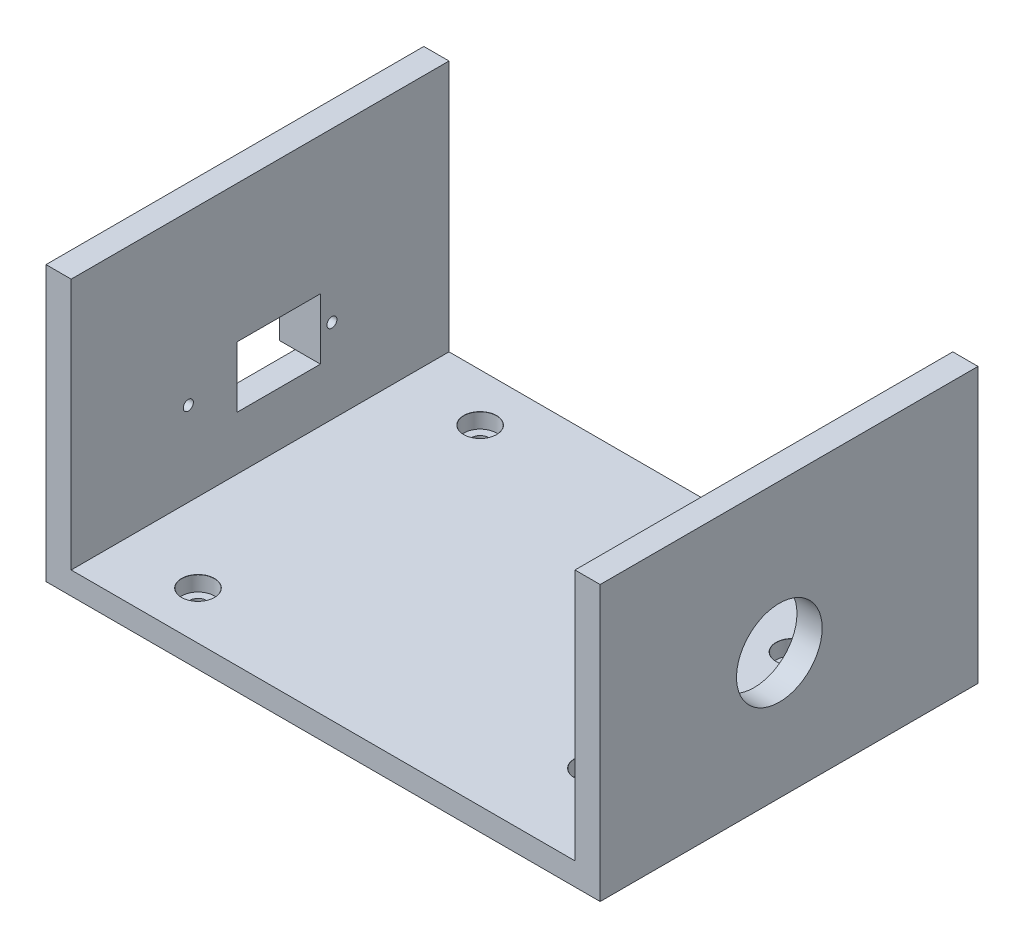
ISO-10303-21;
HEADER;
FILE_DESCRIPTION(('STEP AP214'),'2;1');
FILE_NAME('part.step','',(''),(''),'','','');
FILE_SCHEMA(('AUTOMOTIVE_DESIGN { 1 0 10303 214 1 1 1 1 }'));
ENDSEC;
DATA;
#1=APPLICATION_CONTEXT('core data for automotive mechanical design processes');
#2=APPLICATION_PROTOCOL_DEFINITION('international standard','automotive_design',2000,#1);
#3=PRODUCT_CONTEXT('',#1,'mechanical');
#4=PRODUCT('Part','Part','',(#3));
#5=PRODUCT_RELATED_PRODUCT_CATEGORY('part','',(#4));
#6=PRODUCT_DEFINITION_FORMATION('','',#4);
#7=PRODUCT_DEFINITION_CONTEXT('part definition',#1,'design');
#8=PRODUCT_DEFINITION('design','',#6,#7);
#9=PRODUCT_DEFINITION_SHAPE('','',#8);
#10=(LENGTH_UNIT() NAMED_UNIT(*) SI_UNIT(.MILLI.,.METRE.));
#11=(NAMED_UNIT(*) PLANE_ANGLE_UNIT() SI_UNIT($,.RADIAN.));
#12=(NAMED_UNIT(*) SI_UNIT($,.STERADIAN.) SOLID_ANGLE_UNIT());
#13=UNCERTAINTY_MEASURE_WITH_UNIT(LENGTH_MEASURE(1.E-05),#10,'distance_accuracy_value','');
#14=(GEOMETRIC_REPRESENTATION_CONTEXT(3) GLOBAL_UNCERTAINTY_ASSIGNED_CONTEXT((#13)) GLOBAL_UNIT_ASSIGNED_CONTEXT((#10,
#11,#12)) REPRESENTATION_CONTEXT('',''));
#15=CARTESIAN_POINT('',(0.,0.,0.));
#16=DIRECTION('',(0.,0.,1.));
#17=DIRECTION('',(1.,0.,0.));
#18=AXIS2_PLACEMENT_3D('',#15,#16,#17);
#19=CARTESIAN_POINT('',(-43.8907284768212,0.,-52.2019867549669));
#20=DIRECTION('',(-1.,0.,0.));
#21=DIRECTION('',(0.,0.,1.));
#22=AXIS2_PLACEMENT_3D('',#19,#20,#21);
#23=PLANE('',#22);
#24=DIRECTION('',(0.,0.,1.));
#25=VECTOR('',#24,1.);
#26=CARTESIAN_POINT('',(-43.8907284768212,27.25,0.));
#27=LINE('',#26,#25);
#28=CARTESIAN_POINT('',(-43.8907284768212,27.25,-2.95198675496689));
#29=VERTEX_POINT('',#28);
#30=CARTESIAN_POINT('',(-43.8907284768212,27.25,1.54801324503311));
#31=VERTEX_POINT('',#30);
#32=EDGE_CURVE('E415',#29,#31,#27,.T.);
#33=ORIENTED_EDGE('',*,*,#32,.T.);
#34=DIRECTION('',(0.,1.,0.));
#35=VECTOR('',#34,1.);
#36=CARTESIAN_POINT('',(-43.8907284768212,0.,1.54801324503311));
#37=LINE('',#36,#35);
#38=CARTESIAN_POINT('',(-43.8907284768212,15.15,1.54801324503311));
#39=VERTEX_POINT('',#38);
#40=EDGE_CURVE('E421',#39,#31,#37,.T.);
#41=ORIENTED_EDGE('',*,*,#40,.F.);
#42=DIRECTION('',(0.,0.,1.));
#43=VECTOR('',#42,1.);
#44=CARTESIAN_POINT('',(-43.8907284768212,15.15,0.));
#45=LINE('',#44,#43);
#46=CARTESIAN_POINT('',(-43.8907284768212,15.15,-2.95198675496689));
#47=VERTEX_POINT('',#46);
#48=EDGE_CURVE('E437',#47,#39,#45,.T.);
#49=ORIENTED_EDGE('',*,*,#48,.F.);
#50=DIRECTION('',(0.,-1.,0.));
#51=VECTOR('',#50,1.);
#52=CARTESIAN_POINT('',(-43.8907284768212,0.,-2.95198675496689));
#53=LINE('',#52,#51);
#54=EDGE_CURVE('E434',#29,#47,#53,.T.);
#55=ORIENTED_EDGE('',*,*,#54,.F.);
#56=EDGE_LOOP('',(#33,#41,#49,#55));
#57=FACE_BOUND('',#56,.T.);
#58=DIRECTION('',(0.,1.,0.));
#59=VECTOR('',#58,1.);
#60=CARTESIAN_POINT('',(-43.8907284768212,0.,22.7980132450331));
#61=LINE('',#60,#59);
#62=CARTESIAN_POINT('',(-43.8907284768212,0.,22.7980132450331));
#63=VERTEX_POINT('',#62);
#64=CARTESIAN_POINT('',(-43.8907284768212,54.5,22.7980132450331));
#65=VERTEX_POINT('',#64);
#66=EDGE_CURVE('E282',#63,#65,#61,.T.);
#67=ORIENTED_EDGE('',*,*,#66,.T.);
#68=DIRECTION('',(0.,0.,1.));
#69=VECTOR('',#68,1.);
#70=CARTESIAN_POINT('',(-43.8907284768212,54.5,-52.2019867549669));
#71=LINE('',#70,#69);
#72=CARTESIAN_POINT('',(-43.8907284768212,54.5,-52.2019867549669));
#73=VERTEX_POINT('',#72);
#74=EDGE_CURVE('E258',#73,#65,#71,.T.);
#75=ORIENTED_EDGE('',*,*,#74,.F.);
#76=DIRECTION('',(0.,1.,0.));
#77=VECTOR('',#76,1.);
#78=CARTESIAN_POINT('',(-43.8907284768212,0.,-52.2019867549669));
#79=LINE('',#78,#77);
#80=CARTESIAN_POINT('',(-43.8907284768212,0.,-52.2019867549669));
#81=VERTEX_POINT('',#80);
#82=EDGE_CURVE('E274',#81,#73,#79,.T.);
#83=ORIENTED_EDGE('',*,*,#82,.F.);
#84=DIRECTION('',(0.,0.,1.));
#85=VECTOR('',#84,1.);
#86=CARTESIAN_POINT('',(-43.8907284768212,0.,-52.2019867549669));
#87=LINE('',#86,#85);
#88=EDGE_CURVE('E270',#81,#63,#87,.T.);
#89=ORIENTED_EDGE('',*,*,#88,.T.);
#90=EDGE_LOOP('',(#67,#75,#83,#89));
#91=FACE_BOUND('',#90,.T.);
#92=DIRECTION('',(0.,0.,1.));
#93=VECTOR('',#92,1.);
#94=CARTESIAN_POINT('',(-43.8907284768212,27.25,-52.2019867549669));
#95=LINE('',#94,#93);
#96=CARTESIAN_POINT('',(-43.8907284768212,27.25,-26.6706087203549));
#97=VERTEX_POINT('',#96);
#98=CARTESIAN_POINT('',(-43.8907284768212,27.25,-10.0716026257007));
#99=VERTEX_POINT('',#98);
#100=EDGE_CURVE('E403',#97,#99,#95,.T.);
#101=ORIENTED_EDGE('',*,*,#100,.T.);
#102=DIRECTION('',(0.,-1.,0.));
#103=VECTOR('',#102,1.);
#104=CARTESIAN_POINT('',(-43.8907284768212,0.,-10.0716026257007));
#105=LINE('',#104,#103);
#106=CARTESIAN_POINT('',(-43.8907284768212,15.15,-10.0716026257007));
#107=VERTEX_POINT('',#106);
#108=EDGE_CURVE('E11',#99,#107,#105,.T.);
#109=ORIENTED_EDGE('',*,*,#108,.T.);
#110=DIRECTION('',(0.,0.,-1.));
#111=VECTOR('',#110,1.);
#112=CARTESIAN_POINT('',(-43.8907284768212,15.15,-52.2019867549669));
#113=LINE('',#112,#111);
#114=CARTESIAN_POINT('',(-43.8907284768212,15.15,-26.6706087203549));
#115=VERTEX_POINT('',#114);
#116=EDGE_CURVE('E462',#107,#115,#113,.T.);
#117=ORIENTED_EDGE('',*,*,#116,.T.);
#118=DIRECTION('',(0.,0.,1.));
#119=VECTOR('',#118,1.);
#120=CARTESIAN_POINT('',(-43.8907284768212,15.15,0.));
#121=LINE('',#120,#119);
#122=CARTESIAN_POINT('',(-43.8907284768212,15.15,-30.9519867549669));
#123=VERTEX_POINT('',#122);
#124=EDGE_CURVE('E190',#123,#115,#121,.T.);
#125=ORIENTED_EDGE('',*,*,#124,.F.);
#126=DIRECTION('',(0.,1.,0.));
#127=VECTOR('',#126,1.);
#128=CARTESIAN_POINT('',(-43.8907284768212,0.,-30.9519867549669));
#129=LINE('',#128,#127);
#130=CARTESIAN_POINT('',(-43.8907284768212,27.25,-30.9519867549669));
#131=VERTEX_POINT('',#130);
#132=EDGE_CURVE('E213',#123,#131,#129,.T.);
#133=ORIENTED_EDGE('',*,*,#132,.T.);
#134=DIRECTION('',(0.,0.,1.));
#135=VECTOR('',#134,1.);
#136=CARTESIAN_POINT('',(-43.8907284768212,27.25,0.));
#137=LINE('',#136,#135);
#138=EDGE_CURVE('E209',#131,#97,#137,.T.);
#139=ORIENTED_EDGE('',*,*,#138,.T.);
#140=EDGE_LOOP('',(#101,#109,#117,#125,#133,#139));
#141=FACE_BOUND('',#140,.T.);
#142=ADVANCED_FACE('F41',(#57,#91,#141),#23,.T.);
#143=CARTESIAN_POINT('',(-46.9907284768212,27.25,0.));
#144=DIRECTION('',(0.,1.,0.));
#145=DIRECTION('',(0.,0.,1.));
#146=AXIS2_PLACEMENT_3D('',#143,#144,#145);
#147=PLANE('',#146);
#148=DIRECTION('',(0.,0.,1.));
#149=VECTOR('',#148,1.);
#150=CARTESIAN_POINT('',(-46.9907284768212,27.25,0.));
#151=LINE('',#150,#149);
#152=CARTESIAN_POINT('',(-46.9907284768212,27.25,-30.9519867549669));
#153=VERTEX_POINT('',#152);
#154=CARTESIAN_POINT('',(-46.9907284768212,27.25,-26.6706087203549));
#155=VERTEX_POINT('',#154);
#156=EDGE_CURVE('E205',#153,#155,#151,.T.);
#157=ORIENTED_EDGE('',*,*,#156,.T.);
#158=DIRECTION('',(1.,0.,0.));
#159=VECTOR('',#158,1.);
#160=CARTESIAN_POINT('',(-53.8907284768212,27.25,-26.6706087203549));
#161=LINE('',#160,#159);
#162=EDGE_CURVE('E65',#155,#97,#161,.T.);
#163=ORIENTED_EDGE('',*,*,#162,.T.);
#164=ORIENTED_EDGE('',*,*,#138,.F.);
#165=DIRECTION('',(1.,0.,0.));
#166=VECTOR('',#165,1.);
#167=CARTESIAN_POINT('',(-46.9907284768212,27.25,-30.9519867549669));
#168=LINE('',#167,#166);
#169=EDGE_CURVE('E203',#153,#131,#168,.T.);
#170=ORIENTED_EDGE('',*,*,#169,.F.);
#171=EDGE_LOOP('',(#157,#163,#164,#170));
#172=FACE_BOUND('',#171,.T.);
#173=ADVANCED_FACE('F456',(#172),#147,.T.);
#174=CARTESIAN_POINT('',(-46.9907284768212,15.15,0.));
#175=DIRECTION('',(0.,1.,0.));
#176=DIRECTION('',(0.,0.,1.));
#177=AXIS2_PLACEMENT_3D('',#174,#175,#176);
#178=PLANE('',#177);
#179=DIRECTION('',(1.,0.,0.));
#180=VECTOR('',#179,1.);
#181=CARTESIAN_POINT('',(-53.8907284768212,15.15,-26.6706087203549));
#182=LINE('',#181,#180);
#183=CARTESIAN_POINT('',(-46.9907284768212,15.15,-26.6706087203549));
#184=VERTEX_POINT('',#183);
#185=EDGE_CURVE('E175',#184,#115,#182,.T.);
#186=ORIENTED_EDGE('',*,*,#185,.F.);
#187=DIRECTION('',(0.,0.,1.));
#188=VECTOR('',#187,1.);
#189=CARTESIAN_POINT('',(-46.9907284768212,15.15,0.));
#190=LINE('',#189,#188);
#191=CARTESIAN_POINT('',(-46.9907284768212,15.15,-30.9519867549669));
#192=VERTEX_POINT('',#191);
#193=EDGE_CURVE('E188',#192,#184,#190,.T.);
#194=ORIENTED_EDGE('',*,*,#193,.F.);
#195=DIRECTION('',(1.,0.,0.));
#196=VECTOR('',#195,1.);
#197=CARTESIAN_POINT('',(-46.9907284768212,15.15,-30.9519867549669));
#198=LINE('',#197,#196);
#199=EDGE_CURVE('E199',#192,#123,#198,.T.);
#200=ORIENTED_EDGE('',*,*,#199,.T.);
#201=ORIENTED_EDGE('',*,*,#124,.T.);
#202=EDGE_LOOP('',(#186,#194,#200,#201));
#203=FACE_BOUND('',#202,.T.);
#204=ADVANCED_FACE('F186',(#203),#178,.F.);
#205=CARTESIAN_POINT('',(-46.9907284768212,0.,0.));
#206=DIRECTION('',(-1.,0.,0.));
#207=DIRECTION('',(0.,0.,1.));
#208=AXIS2_PLACEMENT_3D('',#205,#206,#207);
#209=PLANE('',#208);
#210=ORIENTED_EDGE('',*,*,#193,.T.);
#211=DIRECTION('',(0.,1.,0.));
#212=VECTOR('',#211,1.);
#213=CARTESIAN_POINT('',(-46.9907284768212,0.,-26.6706087203549));
#214=LINE('',#213,#212);
#215=EDGE_CURVE('E50',#184,#155,#214,.T.);
#216=ORIENTED_EDGE('',*,*,#215,.T.);
#217=ORIENTED_EDGE('',*,*,#156,.F.);
#218=DIRECTION('',(0.,1.,0.));
#219=VECTOR('',#218,1.);
#220=CARTESIAN_POINT('',(-46.9907284768212,0.,-30.9519867549669));
#221=LINE('',#220,#219);
#222=EDGE_CURVE('E197',#192,#153,#221,.T.);
#223=ORIENTED_EDGE('',*,*,#222,.F.);
#224=EDGE_LOOP('',(#210,#216,#217,#223));
#225=FACE_BOUND('',#224,.T.);
#226=CARTESIAN_POINT('',(-46.9907284768212,21.2,-28.9519867549669));
#227=DIRECTION('',(-1.,0.,0.));
#228=DIRECTION('',(0.,0.,1.));
#229=AXIS2_PLACEMENT_3D('',#226,#227,#228);
#230=CIRCLE('',#229,1.);
#231=CARTESIAN_POINT('',(-46.9907284768212,21.2,-27.9519867549669));
#232=VERTEX_POINT('',#231);
#233=EDGE_CURVE('E391',#232,#232,#230,.F.);
#234=ORIENTED_EDGE('',*,*,#233,.T.);
#235=EDGE_LOOP('',(#234));
#236=FACE_BOUND('',#235,.T.);
#237=ADVANCED_FACE('F194',(#225,#236),#209,.T.);
#238=CARTESIAN_POINT('',(-38.8907284768212,4.5,22.7980132450331));
#239=DIRECTION('',(0.,0.,-1.));
#240=DIRECTION('',(-1.,0.,0.));
#241=AXIS2_PLACEMENT_3D('',#238,#239,#240);
#242=PLANE('',#241);
#243=DIRECTION('',(1.,0.,0.));
#244=VECTOR('',#243,1.);
#245=CARTESIAN_POINT('',(-38.8907284768212,0.,22.7980132450331));
#246=LINE('',#245,#244);
#247=CARTESIAN_POINT('',(66.1092715231788,0.,22.7980132450331));
#248=VERTEX_POINT('',#247);
#249=EDGE_CURVE('E366',#63,#248,#246,.T.);
#250=ORIENTED_EDGE('',*,*,#249,.T.);
#251=DIRECTION('',(0.,1.,0.));
#252=VECTOR('',#251,1.);
#253=CARTESIAN_POINT('',(66.1092715231788,0.,22.7980132450331));
#254=LINE('',#253,#252);
#255=CARTESIAN_POINT('',(66.1092715231788,54.5,22.7980132450331));
#256=VERTEX_POINT('',#255);
#257=EDGE_CURVE('E247',#248,#256,#254,.T.);
#258=ORIENTED_EDGE('',*,*,#257,.T.);
#259=DIRECTION('',(1.,0.,0.));
#260=VECTOR('',#259,1.);
#261=CARTESIAN_POINT('',(61.1092715231788,54.5,22.7980132450331));
#262=LINE('',#261,#260);
#263=CARTESIAN_POINT('',(61.1092715231788,54.5,22.7980132450331));
#264=VERTEX_POINT('',#263);
#265=EDGE_CURVE('E230',#264,#256,#262,.T.);
#266=ORIENTED_EDGE('',*,*,#265,.F.);
#267=DIRECTION('',(0.,1.,0.));
#268=VECTOR('',#267,1.);
#269=CARTESIAN_POINT('',(61.1092715231788,0.,22.7980132450331));
#270=LINE('',#269,#268);
#271=CARTESIAN_POINT('',(61.1092715231788,4.5,22.7980132450331));
#272=VERTEX_POINT('',#271);
#273=EDGE_CURVE('E250',#272,#264,#270,.T.);
#274=ORIENTED_EDGE('',*,*,#273,.F.);
#275=DIRECTION('',(1.,0.,0.));
#276=VECTOR('',#275,1.);
#277=CARTESIAN_POINT('',(-38.8907284768212,4.5,22.7980132450331));
#278=LINE('',#277,#276);
#279=CARTESIAN_POINT('',(-38.8907284768212,4.5,22.7980132450331));
#280=VERTEX_POINT('',#279);
#281=EDGE_CURVE('E371',#280,#272,#278,.T.);
#282=ORIENTED_EDGE('',*,*,#281,.F.);
#283=DIRECTION('',(0.,1.,0.));
#284=VECTOR('',#283,1.);
#285=CARTESIAN_POINT('',(-38.8907284768212,0.,22.7980132450331));
#286=LINE('',#285,#284);
#287=CARTESIAN_POINT('',(-38.8907284768212,54.5,22.7980132450331));
#288=VERTEX_POINT('',#287);
#289=EDGE_CURVE('E279',#280,#288,#286,.T.);
#290=ORIENTED_EDGE('',*,*,#289,.T.);
#291=DIRECTION('',(1.,0.,0.));
#292=VECTOR('',#291,1.);
#293=CARTESIAN_POINT('',(-38.8907284768212,54.5,22.7980132450331));
#294=LINE('',#293,#292);
#295=EDGE_CURVE('E262',#65,#288,#294,.T.);
#296=ORIENTED_EDGE('',*,*,#295,.F.);
#297=ORIENTED_EDGE('',*,*,#66,.F.);
#298=EDGE_LOOP('',(#250,#258,#266,#274,#282,#290,#296,#297));
#299=FACE_BOUND('',#298,.T.);
#300=ADVANCED_FACE('F43',(#299),#242,.F.);
#301=CARTESIAN_POINT('',(-38.8907284768212,4.5,-52.2019867549669));
#302=DIRECTION('',(0.,0.,1.));
#303=DIRECTION('',(1.,0.,0.));
#304=AXIS2_PLACEMENT_3D('',#301,#302,#303);
#305=PLANE('',#304);
#306=DIRECTION('',(-1.,0.,0.));
#307=VECTOR('',#306,1.);
#308=CARTESIAN_POINT('',(-38.8907284768212,0.,-52.2019867549669));
#309=LINE('',#308,#307);
#310=CARTESIAN_POINT('',(66.1092715231788,0.,-52.2019867549669));
#311=VERTEX_POINT('',#310);
#312=EDGE_CURVE('E372',#311,#81,#309,.T.);
#313=ORIENTED_EDGE('',*,*,#312,.T.);
#314=ORIENTED_EDGE('',*,*,#82,.T.);
#315=DIRECTION('',(-1.,0.,0.));
#316=VECTOR('',#315,1.);
#317=CARTESIAN_POINT('',(-38.8907284768212,54.5,-52.2019867549669));
#318=LINE('',#317,#316);
#319=CARTESIAN_POINT('',(-38.8907284768212,54.5,-52.2019867549669));
#320=VERTEX_POINT('',#319);
#321=EDGE_CURVE('E246',#320,#73,#318,.T.);
#322=ORIENTED_EDGE('',*,*,#321,.F.);
#323=DIRECTION('',(0.,1.,0.));
#324=VECTOR('',#323,1.);
#325=CARTESIAN_POINT('',(-38.8907284768212,0.,-52.2019867549669));
#326=LINE('',#325,#324);
#327=CARTESIAN_POINT('',(-38.8907284768212,4.5,-52.2019867549669));
#328=VERTEX_POINT('',#327);
#329=EDGE_CURVE('E275',#328,#320,#326,.T.);
#330=ORIENTED_EDGE('',*,*,#329,.F.);
#331=DIRECTION('',(-1.,0.,0.));
#332=VECTOR('',#331,1.);
#333=CARTESIAN_POINT('',(-38.8907284768212,4.5,-52.2019867549669));
#334=LINE('',#333,#332);
#335=CARTESIAN_POINT('',(61.1092715231788,4.5,-52.2019867549669));
#336=VERTEX_POINT('',#335);
#337=EDGE_CURVE('E182',#336,#328,#334,.T.);
#338=ORIENTED_EDGE('',*,*,#337,.F.);
#339=DIRECTION('',(0.,1.,0.));
#340=VECTOR('',#339,1.);
#341=CARTESIAN_POINT('',(61.1092715231788,0.,-52.2019867549669));
#342=LINE('',#341,#340);
#343=CARTESIAN_POINT('',(61.1092715231788,54.5,-52.2019867549669));
#344=VERTEX_POINT('',#343);
#345=EDGE_CURVE('E242',#336,#344,#342,.T.);
#346=ORIENTED_EDGE('',*,*,#345,.T.);
#347=DIRECTION('',(-1.,0.,0.));
#348=VECTOR('',#347,1.);
#349=CARTESIAN_POINT('',(61.1092715231788,54.5,-52.2019867549669));
#350=LINE('',#349,#348);
#351=CARTESIAN_POINT('',(66.1092715231788,54.5,-52.2019867549669));
#352=VERTEX_POINT('',#351);
#353=EDGE_CURVE('E222',#352,#344,#350,.T.);
#354=ORIENTED_EDGE('',*,*,#353,.F.);
#355=DIRECTION('',(0.,1.,0.));
#356=VECTOR('',#355,1.);
#357=CARTESIAN_POINT('',(66.1092715231788,0.,-52.2019867549669));
#358=LINE('',#357,#356);
#359=EDGE_CURVE('E243',#311,#352,#358,.T.);
#360=ORIENTED_EDGE('',*,*,#359,.F.);
#361=EDGE_LOOP('',(#313,#314,#322,#330,#338,#346,#354,#360));
#362=FACE_BOUND('',#361,.T.);
#363=ADVANCED_FACE('F520',(#362),#305,.F.);
#364=CARTESIAN_POINT('',(0.,4.5,0.));
#365=DIRECTION('',(0.,1.,0.));
#366=DIRECTION('',(0.,0.,1.));
#367=AXIS2_PLACEMENT_3D('',#364,#365,#366);
#368=PLANE('',#367);
#369=CARTESIAN_POINT('',(-23.2190080582348,4.5,-42.7019867549669));
#370=DIRECTION('',(0.,1.,0.));
#371=DIRECTION('',(0.,0.,1.));
#372=AXIS2_PLACEMENT_3D('',#369,#370,#371);
#373=CIRCLE('',#372,3.275);
#374=CARTESIAN_POINT('',(-23.2190080582348,4.5,-39.4269867549669));
#375=VERTEX_POINT('',#374);
#376=EDGE_CURVE('E278',#375,#375,#373,.T.);
#377=ORIENTED_EDGE('',*,*,#376,.F.);
#378=EDGE_LOOP('',(#377));
#379=FACE_BOUND('',#378,.T.);
#380=CARTESIAN_POINT('',(-23.2190080582348,4.5,13.2980132450331));
#381=DIRECTION('',(0.,1.,0.));
#382=DIRECTION('',(0.,0.,1.));
#383=AXIS2_PLACEMENT_3D('',#380,#381,#382);
#384=CIRCLE('',#383,3.275);
#385=CARTESIAN_POINT('',(-23.2190080582348,4.5,16.5730132450331));
#386=VERTEX_POINT('',#385);
#387=EDGE_CURVE('E306',#386,#386,#384,.T.);
#388=ORIENTED_EDGE('',*,*,#387,.F.);
#389=EDGE_LOOP('',(#388));
#390=FACE_BOUND('',#389,.T.);
#391=CARTESIAN_POINT('',(46.7809919417652,4.5,5.29801324503311));
#392=DIRECTION('',(0.,1.,0.));
#393=DIRECTION('',(0.,0.,1.));
#394=AXIS2_PLACEMENT_3D('',#391,#392,#393);
#395=CIRCLE('',#394,3.275);
#396=CARTESIAN_POINT('',(46.7809919417652,4.5,8.57301324503311));
#397=VERTEX_POINT('',#396);
#398=EDGE_CURVE('E326',#397,#397,#395,.T.);
#399=ORIENTED_EDGE('',*,*,#398,.F.);
#400=EDGE_LOOP('',(#399));
#401=FACE_BOUND('',#400,.T.);
#402=CARTESIAN_POINT('',(46.7809919417652,4.5,-34.7019867549669));
#403=DIRECTION('',(0.,1.,0.));
#404=DIRECTION('',(0.,0.,1.));
#405=AXIS2_PLACEMENT_3D('',#402,#403,#404);
#406=CIRCLE('',#405,3.275);
#407=CARTESIAN_POINT('',(46.7809919417652,4.5,-31.4269867549669));
#408=VERTEX_POINT('',#407);
#409=EDGE_CURVE('E346',#408,#408,#406,.T.);
#410=ORIENTED_EDGE('',*,*,#409,.F.);
#411=EDGE_LOOP('',(#410));
#412=FACE_BOUND('',#411,.T.);
#413=DIRECTION('',(0.,0.,1.));
#414=VECTOR('',#413,1.);
#415=CARTESIAN_POINT('',(-38.8907284768212,4.5,-52.2019867549669));
#416=LINE('',#415,#414);
#417=EDGE_CURVE('E367',#328,#280,#416,.T.);
#418=ORIENTED_EDGE('',*,*,#417,.T.);
#419=ORIENTED_EDGE('',*,*,#281,.T.);
#420=DIRECTION('',(0.,0.,-1.));
#421=VECTOR('',#420,1.);
#422=CARTESIAN_POINT('',(61.1092715231788,4.5,-52.2019867549669));
#423=LINE('',#422,#421);
#424=EDGE_CURVE('E376',#272,#336,#423,.T.);
#425=ORIENTED_EDGE('',*,*,#424,.T.);
#426=ORIENTED_EDGE('',*,*,#337,.T.);
#427=EDGE_LOOP('',(#418,#419,#425,#426));
#428=FACE_BOUND('',#427,.T.);
#429=ADVANCED_FACE('F542',(#379,#390,#401,#412,#428),#368,.T.);
#430=CARTESIAN_POINT('',(0.,0.,0.));
#431=DIRECTION('',(0.,1.,0.));
#432=DIRECTION('',(0.,0.,1.));
#433=AXIS2_PLACEMENT_3D('',#430,#431,#432);
#434=PLANE('',#433);
#435=CARTESIAN_POINT('',(-23.2190080582348,0.,-42.7019867549669));
#436=DIRECTION('',(0.,1.,0.));
#437=DIRECTION('',(0.,0.,1.));
#438=AXIS2_PLACEMENT_3D('',#435,#436,#437);
#439=CIRCLE('',#438,1.7);
#440=CARTESIAN_POINT('',(-23.2190080582348,0.,-41.0019867549669));
#441=VERTEX_POINT('',#440);
#442=EDGE_CURVE('E302',#441,#441,#439,.T.);
#443=ORIENTED_EDGE('',*,*,#442,.T.);
#444=EDGE_LOOP('',(#443));
#445=FACE_BOUND('',#444,.T.);
#446=CARTESIAN_POINT('',(-23.2190080582348,0.,13.2980132450331));
#447=DIRECTION('',(0.,1.,0.));
#448=DIRECTION('',(0.,0.,1.));
#449=AXIS2_PLACEMENT_3D('',#446,#447,#448);
#450=CIRCLE('',#449,1.7);
#451=CARTESIAN_POINT('',(-23.2190080582348,0.,14.9980132450331));
#452=VERTEX_POINT('',#451);
#453=EDGE_CURVE('E322',#452,#452,#450,.T.);
#454=ORIENTED_EDGE('',*,*,#453,.T.);
#455=EDGE_LOOP('',(#454));
#456=FACE_BOUND('',#455,.T.);
#457=CARTESIAN_POINT('',(46.7809919417652,0.,5.29801324503311));
#458=DIRECTION('',(0.,1.,0.));
#459=DIRECTION('',(0.,0.,1.));
#460=AXIS2_PLACEMENT_3D('',#457,#458,#459);
#461=CIRCLE('',#460,1.7);
#462=CARTESIAN_POINT('',(46.7809919417652,0.,6.99801324503311));
#463=VERTEX_POINT('',#462);
#464=EDGE_CURVE('E342',#463,#463,#461,.T.);
#465=ORIENTED_EDGE('',*,*,#464,.T.);
#466=EDGE_LOOP('',(#465));
#467=FACE_BOUND('',#466,.T.);
#468=CARTESIAN_POINT('',(46.7809919417652,0.,-34.7019867549669));
#469=DIRECTION('',(0.,1.,0.));
#470=DIRECTION('',(0.,0.,1.));
#471=AXIS2_PLACEMENT_3D('',#468,#469,#470);
#472=CIRCLE('',#471,1.7);
#473=CARTESIAN_POINT('',(46.7809919417652,0.,-33.0019867549669));
#474=VERTEX_POINT('',#473);
#475=EDGE_CURVE('E362',#474,#474,#472,.T.);
#476=ORIENTED_EDGE('',*,*,#475,.T.);
#477=EDGE_LOOP('',(#476));
#478=FACE_BOUND('',#477,.T.);
#479=ORIENTED_EDGE('',*,*,#249,.F.);
#480=ORIENTED_EDGE('',*,*,#88,.F.);
#481=ORIENTED_EDGE('',*,*,#312,.F.);
#482=DIRECTION('',(0.,0.,-1.));
#483=VECTOR('',#482,1.);
#484=CARTESIAN_POINT('',(66.1092715231788,0.,-52.2019867549669));
#485=LINE('',#484,#483);
#486=EDGE_CURVE('E238',#248,#311,#485,.T.);
#487=ORIENTED_EDGE('',*,*,#486,.F.);
#488=EDGE_LOOP('',(#479,#480,#481,#487));
#489=FACE_BOUND('',#488,.T.);
#490=ADVANCED_FACE('F530',(#445,#456,#467,#478,#489),#434,.F.);
#491=CARTESIAN_POINT('',(46.7809919417652,4.5,-34.7019867549669));
#492=DIRECTION('',(0.,1.,0.));
#493=DIRECTION('',(0.,0.,1.));
#494=AXIS2_PLACEMENT_3D('',#491,#492,#493);
#495=CYLINDRICAL_SURFACE('',#494,1.7);
#496=ORIENTED_EDGE('',*,*,#475,.F.);
#497=EDGE_LOOP('',(#496));
#498=FACE_BOUND('',#497,.T.);
#499=CARTESIAN_POINT('',(46.7809919417652,1.5,-34.7019867549669));
#500=DIRECTION('',(0.,1.,0.));
#501=DIRECTION('',(0.,0.,1.));
#502=AXIS2_PLACEMENT_3D('',#499,#500,#501);
#503=CIRCLE('',#502,1.7);
#504=CARTESIAN_POINT('',(46.7809919417652,1.5,-33.0019867549669));
#505=VERTEX_POINT('',#504);
#506=EDGE_CURVE('E358',#505,#505,#503,.T.);
#507=ORIENTED_EDGE('',*,*,#506,.T.);
#508=EDGE_LOOP('',(#507));
#509=FACE_BOUND('',#508,.T.);
#510=ADVANCED_FACE('F617',(#498,#509),#495,.F.);
#511=CARTESIAN_POINT('',(50.0309919417652,1.5,-34.7019867549669));
#512=DIRECTION('',(0.,-1.,0.));
#513=DIRECTION('',(0.,0.,-1.));
#514=AXIS2_PLACEMENT_3D('',#511,#512,#513);
#515=PLANE('',#514);
#516=ORIENTED_EDGE('',*,*,#506,.F.);
#517=EDGE_LOOP('',(#516));
#518=FACE_BOUND('',#517,.T.);
#519=CARTESIAN_POINT('',(46.7809919417652,1.5,-34.7019867549669));
#520=DIRECTION('',(0.,1.,0.));
#521=DIRECTION('',(0.,0.,1.));
#522=AXIS2_PLACEMENT_3D('',#519,#520,#521);
#523=CIRCLE('',#522,3.25);
#524=CARTESIAN_POINT('',(46.7809919417652,1.5,-31.4519867549669));
#525=VERTEX_POINT('',#524);
#526=EDGE_CURVE('E354',#525,#525,#523,.T.);
#527=ORIENTED_EDGE('',*,*,#526,.T.);
#528=EDGE_LOOP('',(#527));
#529=FACE_BOUND('',#528,.T.);
#530=ADVANCED_FACE('F613',(#518,#529),#515,.F.);
#531=CARTESIAN_POINT('',(46.7809919417652,4.5,-34.7019867549669));
#532=DIRECTION('',(0.,1.,0.));
#533=DIRECTION('',(0.,0.,1.));
#534=AXIS2_PLACEMENT_3D('',#531,#532,#533);
#535=CYLINDRICAL_SURFACE('',#534,3.25);
#536=ORIENTED_EDGE('',*,*,#526,.F.);
#537=EDGE_LOOP('',(#536));
#538=FACE_BOUND('',#537,.T.);
#539=CARTESIAN_POINT('',(46.7809919417652,4.475,-34.7019867549669));
#540=DIRECTION('',(0.,1.,0.));
#541=DIRECTION('',(0.,0.,1.));
#542=AXIS2_PLACEMENT_3D('',#539,#540,#541);
#543=CIRCLE('',#542,3.25);
#544=CARTESIAN_POINT('',(46.7809919417652,4.475,-31.4519867549669));
#545=VERTEX_POINT('',#544);
#546=EDGE_CURVE('E350',#545,#545,#543,.T.);
#547=ORIENTED_EDGE('',*,*,#546,.T.);
#548=EDGE_LOOP('',(#547));
#549=FACE_BOUND('',#548,.T.);
#550=ADVANCED_FACE('F609',(#538,#549),#535,.F.);
#551=CARTESIAN_POINT('',(46.7809919417652,4.5,-34.7019867549669));
#552=DIRECTION('',(0.,1.,0.));
#553=DIRECTION('',(0.,0.,1.));
#554=AXIS2_PLACEMENT_3D('',#551,#552,#553);
#555=CONICAL_SURFACE('',#554,3.275,0.785398163397396);
#556=ORIENTED_EDGE('',*,*,#546,.F.);
#557=EDGE_LOOP('',(#556));
#558=FACE_BOUND('',#557,.T.);
#559=ORIENTED_EDGE('',*,*,#409,.T.);
#560=EDGE_LOOP('',(#559));
#561=FACE_BOUND('',#560,.T.);
#562=ADVANCED_FACE('F605',(#558,#561),#555,.F.);
#563=CARTESIAN_POINT('',(46.7809919417652,4.5,5.29801324503311));
#564=DIRECTION('',(0.,1.,0.));
#565=DIRECTION('',(0.,0.,1.));
#566=AXIS2_PLACEMENT_3D('',#563,#564,#565);
#567=CYLINDRICAL_SURFACE('',#566,1.7);
#568=ORIENTED_EDGE('',*,*,#464,.F.);
#569=EDGE_LOOP('',(#568));
#570=FACE_BOUND('',#569,.T.);
#571=CARTESIAN_POINT('',(46.7809919417652,1.5,5.29801324503311));
#572=DIRECTION('',(0.,1.,0.));
#573=DIRECTION('',(0.,0.,1.));
#574=AXIS2_PLACEMENT_3D('',#571,#572,#573);
#575=CIRCLE('',#574,1.7);
#576=CARTESIAN_POINT('',(46.7809919417652,1.5,6.99801324503311));
#577=VERTEX_POINT('',#576);
#578=EDGE_CURVE('E338',#577,#577,#575,.T.);
#579=ORIENTED_EDGE('',*,*,#578,.T.);
#580=EDGE_LOOP('',(#579));
#581=FACE_BOUND('',#580,.T.);
#582=ADVANCED_FACE('F601',(#570,#581),#567,.F.);
#583=CARTESIAN_POINT('',(50.0309919417652,1.5,5.29801324503311));
#584=DIRECTION('',(0.,-1.,0.));
#585=DIRECTION('',(0.,0.,-1.));
#586=AXIS2_PLACEMENT_3D('',#583,#584,#585);
#587=PLANE('',#586);
#588=ORIENTED_EDGE('',*,*,#578,.F.);
#589=EDGE_LOOP('',(#588));
#590=FACE_BOUND('',#589,.T.);
#591=CARTESIAN_POINT('',(46.7809919417652,1.5,5.29801324503311));
#592=DIRECTION('',(0.,1.,0.));
#593=DIRECTION('',(0.,0.,1.));
#594=AXIS2_PLACEMENT_3D('',#591,#592,#593);
#595=CIRCLE('',#594,3.25);
#596=CARTESIAN_POINT('',(46.7809919417652,1.5,8.54801324503311));
#597=VERTEX_POINT('',#596);
#598=EDGE_CURVE('E334',#597,#597,#595,.T.);
#599=ORIENTED_EDGE('',*,*,#598,.T.);
#600=EDGE_LOOP('',(#599));
#601=FACE_BOUND('',#600,.T.);
#602=ADVANCED_FACE('F597',(#590,#601),#587,.F.);
#603=CARTESIAN_POINT('',(46.7809919417652,4.5,5.29801324503311));
#604=DIRECTION('',(0.,1.,0.));
#605=DIRECTION('',(0.,0.,1.));
#606=AXIS2_PLACEMENT_3D('',#603,#604,#605);
#607=CYLINDRICAL_SURFACE('',#606,3.25);
#608=ORIENTED_EDGE('',*,*,#598,.F.);
#609=EDGE_LOOP('',(#608));
#610=FACE_BOUND('',#609,.T.);
#611=CARTESIAN_POINT('',(46.7809919417652,4.475,5.29801324503311));
#612=DIRECTION('',(0.,1.,0.));
#613=DIRECTION('',(0.,0.,1.));
#614=AXIS2_PLACEMENT_3D('',#611,#612,#613);
#615=CIRCLE('',#614,3.25);
#616=CARTESIAN_POINT('',(46.7809919417652,4.475,8.54801324503311));
#617=VERTEX_POINT('',#616);
#618=EDGE_CURVE('E330',#617,#617,#615,.T.);
#619=ORIENTED_EDGE('',*,*,#618,.T.);
#620=EDGE_LOOP('',(#619));
#621=FACE_BOUND('',#620,.T.);
#622=ADVANCED_FACE('F593',(#610,#621),#607,.F.);
#623=CARTESIAN_POINT('',(46.7809919417652,4.5,5.29801324503311));
#624=DIRECTION('',(0.,1.,0.));
#625=DIRECTION('',(0.,0.,1.));
#626=AXIS2_PLACEMENT_3D('',#623,#624,#625);
#627=CONICAL_SURFACE('',#626,3.275,0.785398163397396);
#628=ORIENTED_EDGE('',*,*,#618,.F.);
#629=EDGE_LOOP('',(#628));
#630=FACE_BOUND('',#629,.T.);
#631=ORIENTED_EDGE('',*,*,#398,.T.);
#632=EDGE_LOOP('',(#631));
#633=FACE_BOUND('',#632,.T.);
#634=ADVANCED_FACE('F589',(#630,#633),#627,.F.);
#635=CARTESIAN_POINT('',(-23.2190080582348,4.5,13.2980132450331));
#636=DIRECTION('',(0.,1.,0.));
#637=DIRECTION('',(0.,0.,1.));
#638=AXIS2_PLACEMENT_3D('',#635,#636,#637);
#639=CYLINDRICAL_SURFACE('',#638,1.7);
#640=ORIENTED_EDGE('',*,*,#453,.F.);
#641=EDGE_LOOP('',(#640));
#642=FACE_BOUND('',#641,.T.);
#643=CARTESIAN_POINT('',(-23.2190080582348,1.5,13.2980132450331));
#644=DIRECTION('',(0.,1.,0.));
#645=DIRECTION('',(0.,0.,1.));
#646=AXIS2_PLACEMENT_3D('',#643,#644,#645);
#647=CIRCLE('',#646,1.7);
#648=CARTESIAN_POINT('',(-23.2190080582348,1.5,14.9980132450331));
#649=VERTEX_POINT('',#648);
#650=EDGE_CURVE('E318',#649,#649,#647,.T.);
#651=ORIENTED_EDGE('',*,*,#650,.T.);
#652=EDGE_LOOP('',(#651));
#653=FACE_BOUND('',#652,.T.);
#654=ADVANCED_FACE('F585',(#642,#653),#639,.F.);
#655=CARTESIAN_POINT('',(-19.9690080582348,1.5,13.2980132450331));
#656=DIRECTION('',(0.,-1.,0.));
#657=DIRECTION('',(0.,0.,-1.));
#658=AXIS2_PLACEMENT_3D('',#655,#656,#657);
#659=PLANE('',#658);
#660=ORIENTED_EDGE('',*,*,#650,.F.);
#661=EDGE_LOOP('',(#660));
#662=FACE_BOUND('',#661,.T.);
#663=CARTESIAN_POINT('',(-23.2190080582348,1.5,13.2980132450331));
#664=DIRECTION('',(0.,1.,0.));
#665=DIRECTION('',(0.,0.,1.));
#666=AXIS2_PLACEMENT_3D('',#663,#664,#665);
#667=CIRCLE('',#666,3.25);
#668=CARTESIAN_POINT('',(-23.2190080582348,1.5,16.5480132450331));
#669=VERTEX_POINT('',#668);
#670=EDGE_CURVE('E314',#669,#669,#667,.T.);
#671=ORIENTED_EDGE('',*,*,#670,.T.);
#672=EDGE_LOOP('',(#671));
#673=FACE_BOUND('',#672,.T.);
#674=ADVANCED_FACE('F581',(#662,#673),#659,.F.);
#675=CARTESIAN_POINT('',(-23.2190080582348,4.5,13.2980132450331));
#676=DIRECTION('',(0.,1.,0.));
#677=DIRECTION('',(0.,0.,1.));
#678=AXIS2_PLACEMENT_3D('',#675,#676,#677);
#679=CYLINDRICAL_SURFACE('',#678,3.25);
#680=ORIENTED_EDGE('',*,*,#670,.F.);
#681=EDGE_LOOP('',(#680));
#682=FACE_BOUND('',#681,.T.);
#683=CARTESIAN_POINT('',(-23.2190080582348,4.475,13.2980132450331));
#684=DIRECTION('',(0.,1.,0.));
#685=DIRECTION('',(0.,0.,1.));
#686=AXIS2_PLACEMENT_3D('',#683,#684,#685);
#687=CIRCLE('',#686,3.25);
#688=CARTESIAN_POINT('',(-23.2190080582348,4.475,16.5480132450331));
#689=VERTEX_POINT('',#688);
#690=EDGE_CURVE('E310',#689,#689,#687,.T.);
#691=ORIENTED_EDGE('',*,*,#690,.T.);
#692=EDGE_LOOP('',(#691));
#693=FACE_BOUND('',#692,.T.);
#694=ADVANCED_FACE('F577',(#682,#693),#679,.F.);
#695=CARTESIAN_POINT('',(-23.2190080582348,4.5,13.2980132450331));
#696=DIRECTION('',(0.,1.,0.));
#697=DIRECTION('',(0.,0.,1.));
#698=AXIS2_PLACEMENT_3D('',#695,#696,#697);
#699=CONICAL_SURFACE('',#698,3.275,0.785398163397466);
#700=ORIENTED_EDGE('',*,*,#690,.F.);
#701=EDGE_LOOP('',(#700));
#702=FACE_BOUND('',#701,.T.);
#703=ORIENTED_EDGE('',*,*,#387,.T.);
#704=EDGE_LOOP('',(#703));
#705=FACE_BOUND('',#704,.T.);
#706=ADVANCED_FACE('F573',(#702,#705),#699,.F.);
#707=CARTESIAN_POINT('',(-23.2190080582348,4.5,-42.7019867549669));
#708=DIRECTION('',(0.,1.,0.));
#709=DIRECTION('',(0.,0.,1.));
#710=AXIS2_PLACEMENT_3D('',#707,#708,#709);
#711=CYLINDRICAL_SURFACE('',#710,1.7);
#712=ORIENTED_EDGE('',*,*,#442,.F.);
#713=EDGE_LOOP('',(#712));
#714=FACE_BOUND('',#713,.T.);
#715=CARTESIAN_POINT('',(-23.2190080582348,1.5,-42.7019867549669));
#716=DIRECTION('',(0.,1.,0.));
#717=DIRECTION('',(0.,0.,1.));
#718=AXIS2_PLACEMENT_3D('',#715,#716,#717);
#719=CIRCLE('',#718,1.7);
#720=CARTESIAN_POINT('',(-23.2190080582348,1.5,-41.0019867549669));
#721=VERTEX_POINT('',#720);
#722=EDGE_CURVE('E298',#721,#721,#719,.T.);
#723=ORIENTED_EDGE('',*,*,#722,.T.);
#724=EDGE_LOOP('',(#723));
#725=FACE_BOUND('',#724,.T.);
#726=ADVANCED_FACE('F569',(#714,#725),#711,.F.);
#727=CARTESIAN_POINT('',(-19.9690080582348,1.5,-42.7019867549669));
#728=DIRECTION('',(0.,-1.,0.));
#729=DIRECTION('',(0.,0.,-1.));
#730=AXIS2_PLACEMENT_3D('',#727,#728,#729);
#731=PLANE('',#730);
#732=ORIENTED_EDGE('',*,*,#722,.F.);
#733=EDGE_LOOP('',(#732));
#734=FACE_BOUND('',#733,.T.);
#735=CARTESIAN_POINT('',(-23.2190080582348,1.5,-42.7019867549669));
#736=DIRECTION('',(0.,1.,0.));
#737=DIRECTION('',(0.,0.,1.));
#738=AXIS2_PLACEMENT_3D('',#735,#736,#737);
#739=CIRCLE('',#738,3.25);
#740=CARTESIAN_POINT('',(-23.2190080582348,1.5,-39.4519867549669));
#741=VERTEX_POINT('',#740);
#742=EDGE_CURVE('E294',#741,#741,#739,.T.);
#743=ORIENTED_EDGE('',*,*,#742,.T.);
#744=EDGE_LOOP('',(#743));
#745=FACE_BOUND('',#744,.T.);
#746=ADVANCED_FACE('F565',(#734,#745),#731,.F.);
#747=CARTESIAN_POINT('',(-23.2190080582348,4.5,-42.7019867549669));
#748=DIRECTION('',(0.,1.,0.));
#749=DIRECTION('',(0.,0.,1.));
#750=AXIS2_PLACEMENT_3D('',#747,#748,#749);
#751=CYLINDRICAL_SURFACE('',#750,3.25);
#752=ORIENTED_EDGE('',*,*,#742,.F.);
#753=EDGE_LOOP('',(#752));
#754=FACE_BOUND('',#753,.T.);
#755=CARTESIAN_POINT('',(-23.2190080582348,4.475,-42.7019867549669));
#756=DIRECTION('',(0.,1.,0.));
#757=DIRECTION('',(0.,0.,1.));
#758=AXIS2_PLACEMENT_3D('',#755,#756,#757);
#759=CIRCLE('',#758,3.25);
#760=CARTESIAN_POINT('',(-23.2190080582348,4.475,-39.4519867549669));
#761=VERTEX_POINT('',#760);
#762=EDGE_CURVE('E290',#761,#761,#759,.T.);
#763=ORIENTED_EDGE('',*,*,#762,.T.);
#764=EDGE_LOOP('',(#763));
#765=FACE_BOUND('',#764,.T.);
#766=ADVANCED_FACE('F552',(#754,#765),#751,.F.);
#767=CARTESIAN_POINT('',(-23.2190080582348,4.5,-42.7019867549669));
#768=DIRECTION('',(0.,1.,0.));
#769=DIRECTION('',(0.,0.,1.));
#770=AXIS2_PLACEMENT_3D('',#767,#768,#769);
#771=CONICAL_SURFACE('',#770,3.275,0.785398163397466);
#772=ORIENTED_EDGE('',*,*,#762,.F.);
#773=EDGE_LOOP('',(#772));
#774=FACE_BOUND('',#773,.T.);
#775=ORIENTED_EDGE('',*,*,#376,.T.);
#776=EDGE_LOOP('',(#775));
#777=FACE_BOUND('',#776,.T.);
#778=ADVANCED_FACE('F544',(#774,#777),#771,.F.);
#779=CARTESIAN_POINT('',(-38.8907284768212,0.,-52.2019867549669));
#780=DIRECTION('',(1.,0.,0.));
#781=DIRECTION('',(0.,0.,-1.));
#782=AXIS2_PLACEMENT_3D('',#779,#780,#781);
#783=PLANE('',#782);
#784=CARTESIAN_POINT('',(-38.8907284768212,21.2,-28.9519867549669));
#785=DIRECTION('',(1.,0.,0.));
#786=DIRECTION('',(0.,0.,-1.));
#787=AXIS2_PLACEMENT_3D('',#784,#785,#786);
#788=CIRCLE('',#787,1.);
#789=CARTESIAN_POINT('',(-38.8907284768212,21.2,-29.9519867549669));
#790=VERTEX_POINT('',#789);
#791=EDGE_CURVE('E394',#790,#790,#788,.F.);
#792=ORIENTED_EDGE('',*,*,#791,.T.);
#793=EDGE_LOOP('',(#792));
#794=FACE_BOUND('',#793,.T.);
#795=DIRECTION('',(0.,0.,1.));
#796=VECTOR('',#795,1.);
#797=CARTESIAN_POINT('',(-38.8907284768212,15.15,-52.2019867549669));
#798=LINE('',#797,#796);
#799=CARTESIAN_POINT('',(-38.8907284768212,15.15,-26.6706087203549));
#800=VERTEX_POINT('',#799);
#801=CARTESIAN_POINT('',(-38.8907284768212,15.15,-10.0716026257007));
#802=VERTEX_POINT('',#801);
#803=EDGE_CURVE('E466',#800,#802,#798,.T.);
#804=ORIENTED_EDGE('',*,*,#803,.T.);
#805=DIRECTION('',(0.,1.,0.));
#806=VECTOR('',#805,1.);
#807=CARTESIAN_POINT('',(-38.8907284768212,0.,-10.0716026257007));
#808=LINE('',#807,#806);
#809=CARTESIAN_POINT('',(-38.8907284768212,27.25,-10.0716026257007));
#810=VERTEX_POINT('',#809);
#811=EDGE_CURVE('E400',#802,#810,#808,.T.);
#812=ORIENTED_EDGE('',*,*,#811,.T.);
#813=DIRECTION('',(0.,0.,-1.));
#814=VECTOR('',#813,1.);
#815=CARTESIAN_POINT('',(-38.8907284768212,27.25,-52.2019867549669));
#816=LINE('',#815,#814);
#817=CARTESIAN_POINT('',(-38.8907284768212,27.25,-26.6706087203549));
#818=VERTEX_POINT('',#817);
#819=EDGE_CURVE('E395',#810,#818,#816,.T.);
#820=ORIENTED_EDGE('',*,*,#819,.T.);
#821=DIRECTION('',(0.,-1.,0.));
#822=VECTOR('',#821,1.);
#823=CARTESIAN_POINT('',(-38.8907284768212,0.,-26.6706087203549));
#824=LINE('',#823,#822);
#825=EDGE_CURVE('E409',#818,#800,#824,.T.);
#826=ORIENTED_EDGE('',*,*,#825,.T.);
#827=EDGE_LOOP('',(#804,#812,#820,#826));
#828=FACE_BOUND('',#827,.T.);
#829=CARTESIAN_POINT('',(-38.8907284768212,21.2,-0.451986754966886));
#830=DIRECTION('',(1.,0.,0.));
#831=DIRECTION('',(0.,0.,-1.));
#832=AXIS2_PLACEMENT_3D('',#829,#830,#831);
#833=CIRCLE('',#832,1.);
#834=CARTESIAN_POINT('',(-38.8907284768212,21.2,-1.45198675496689));
#835=VERTEX_POINT('',#834);
#836=EDGE_CURVE('E390',#835,#835,#833,.F.);
#837=ORIENTED_EDGE('',*,*,#836,.T.);
#838=EDGE_LOOP('',(#837));
#839=FACE_BOUND('',#838,.T.);
#840=ORIENTED_EDGE('',*,*,#417,.F.);
#841=ORIENTED_EDGE('',*,*,#329,.T.);
#842=DIRECTION('',(0.,0.,-1.));
#843=VECTOR('',#842,1.);
#844=CARTESIAN_POINT('',(-38.8907284768212,54.5,-52.2019867549669));
#845=LINE('',#844,#843);
#846=EDGE_CURVE('E266',#288,#320,#845,.T.);
#847=ORIENTED_EDGE('',*,*,#846,.F.);
#848=ORIENTED_EDGE('',*,*,#289,.F.);
#849=EDGE_LOOP('',(#840,#841,#847,#848));
#850=FACE_BOUND('',#849,.T.);
#851=ADVANCED_FACE('F483',(#794,#828,#839,#850),#783,.T.);
#852=CARTESIAN_POINT('',(0.,54.5,0.));
#853=DIRECTION('',(0.,1.,0.));
#854=DIRECTION('',(0.,0.,1.));
#855=AXIS2_PLACEMENT_3D('',#852,#853,#854);
#856=PLANE('',#855);
#857=ORIENTED_EDGE('',*,*,#321,.T.);
#858=ORIENTED_EDGE('',*,*,#74,.T.);
#859=ORIENTED_EDGE('',*,*,#295,.T.);
#860=ORIENTED_EDGE('',*,*,#846,.T.);
#861=EDGE_LOOP('',(#857,#858,#859,#860));
#862=FACE_BOUND('',#861,.T.);
#863=ADVANCED_FACE('F538',(#862),#856,.T.);
#864=CARTESIAN_POINT('',(61.1092715231788,0.,-52.2019867549669));
#865=DIRECTION('',(-1.,0.,0.));
#866=DIRECTION('',(0.,0.,1.));
#867=AXIS2_PLACEMENT_3D('',#864,#865,#866);
#868=PLANE('',#867);
#869=CARTESIAN_POINT('',(61.1092715231788,25.,-12.7676847182058));
#870=DIRECTION('',(-1.,0.,0.));
#871=DIRECTION('',(0.,0.,1.));
#872=AXIS2_PLACEMENT_3D('',#869,#870,#871);
#873=CIRCLE('',#872,8.5);
#874=CARTESIAN_POINT('',(61.1092715231788,25.,-4.26768471820582));
#875=VERTEX_POINT('',#874);
#876=EDGE_CURVE('E493',#875,#875,#873,.T.);
#877=ORIENTED_EDGE('',*,*,#876,.F.);
#878=EDGE_LOOP('',(#877));
#879=FACE_BOUND('',#878,.T.);
#880=ORIENTED_EDGE('',*,*,#424,.F.);
#881=ORIENTED_EDGE('',*,*,#273,.T.);
#882=DIRECTION('',(0.,0.,1.));
#883=VECTOR('',#882,1.);
#884=CARTESIAN_POINT('',(61.1092715231788,54.5,-52.2019867549669));
#885=LINE('',#884,#883);
#886=EDGE_CURVE('E226',#344,#264,#885,.T.);
#887=ORIENTED_EDGE('',*,*,#886,.F.);
#888=ORIENTED_EDGE('',*,*,#345,.F.);
#889=EDGE_LOOP('',(#880,#881,#887,#888));
#890=FACE_BOUND('',#889,.T.);
#891=ADVANCED_FACE('F510',(#879,#890),#868,.T.);
#892=CARTESIAN_POINT('',(66.1092715231788,0.,-52.2019867549669));
#893=DIRECTION('',(1.,0.,0.));
#894=DIRECTION('',(0.,0.,-1.));
#895=AXIS2_PLACEMENT_3D('',#892,#893,#894);
#896=PLANE('',#895);
#897=CARTESIAN_POINT('',(66.1092715231788,25.,-12.7676847182058));
#898=DIRECTION('',(1.,0.,0.));
#899=DIRECTION('',(0.,0.,-1.));
#900=AXIS2_PLACEMENT_3D('',#897,#898,#899);
#901=CIRCLE('',#900,8.5);
#902=CARTESIAN_POINT('',(66.1092715231788,25.,-21.2676847182058));
#903=VERTEX_POINT('',#902);
#904=EDGE_CURVE('E497',#903,#903,#901,.T.);
#905=ORIENTED_EDGE('',*,*,#904,.F.);
#906=EDGE_LOOP('',(#905));
#907=FACE_BOUND('',#906,.T.);
#908=ORIENTED_EDGE('',*,*,#359,.T.);
#909=DIRECTION('',(0.,0.,-1.));
#910=VECTOR('',#909,1.);
#911=CARTESIAN_POINT('',(66.1092715231788,54.5,-52.2019867549669));
#912=LINE('',#911,#910);
#913=EDGE_CURVE('E234',#256,#352,#912,.T.);
#914=ORIENTED_EDGE('',*,*,#913,.F.);
#915=ORIENTED_EDGE('',*,*,#257,.F.);
#916=ORIENTED_EDGE('',*,*,#486,.T.);
#917=EDGE_LOOP('',(#908,#914,#915,#916));
#918=FACE_BOUND('',#917,.T.);
#919=ADVANCED_FACE('F506',(#907,#918),#896,.T.);
#920=CARTESIAN_POINT('',(0.,54.5,0.));
#921=DIRECTION('',(0.,-1.,0.));
#922=DIRECTION('',(0.,0.,-1.));
#923=AXIS2_PLACEMENT_3D('',#920,#921,#922);
#924=PLANE('',#923);
#925=ORIENTED_EDGE('',*,*,#353,.T.);
#926=ORIENTED_EDGE('',*,*,#886,.T.);
#927=ORIENTED_EDGE('',*,*,#265,.T.);
#928=ORIENTED_EDGE('',*,*,#913,.T.);
#929=EDGE_LOOP('',(#925,#926,#927,#928));
#930=FACE_BOUND('',#929,.T.);
#931=ADVANCED_FACE('F509',(#930),#924,.F.);
#932=CARTESIAN_POINT('',(-46.9907284768212,0.,-30.9519867549669));
#933=DIRECTION('',(0.,0.,-1.));
#934=DIRECTION('',(0.,1.,0.));
#935=AXIS2_PLACEMENT_3D('',#932,#933,#934);
#936=PLANE('',#935);
#937=ORIENTED_EDGE('',*,*,#132,.F.);
#938=ORIENTED_EDGE('',*,*,#199,.F.);
#939=ORIENTED_EDGE('',*,*,#222,.T.);
#940=ORIENTED_EDGE('',*,*,#169,.T.);
#941=EDGE_LOOP('',(#937,#938,#939,#940));
#942=FACE_BOUND('',#941,.T.);
#943=ADVANCED_FACE('F460',(#942),#936,.T.);
#944=CARTESIAN_POINT('',(-46.9907284768212,27.25,0.));
#945=DIRECTION('',(0.,1.,0.));
#946=DIRECTION('',(0.,0.,1.));
#947=AXIS2_PLACEMENT_3D('',#944,#945,#946);
#948=PLANE('',#947);
#949=ORIENTED_EDGE('',*,*,#32,.F.);
#950=DIRECTION('',(1.,0.,0.));
#951=VECTOR('',#950,1.);
#952=CARTESIAN_POINT('',(-46.9907284768212,27.25,-2.95198675496689));
#953=LINE('',#952,#951);
#954=CARTESIAN_POINT('',(-46.9907284768212,27.25,-2.95198675496689));
#955=VERTEX_POINT('',#954);
#956=EDGE_CURVE('E214',#955,#29,#953,.T.);
#957=ORIENTED_EDGE('',*,*,#956,.F.);
#958=DIRECTION('',(0.,0.,1.));
#959=VECTOR('',#958,1.);
#960=CARTESIAN_POINT('',(-46.9907284768212,27.25,0.));
#961=LINE('',#960,#959);
#962=CARTESIAN_POINT('',(-46.9907284768212,27.25,1.54801324503311));
#963=VERTEX_POINT('',#962);
#964=EDGE_CURVE('E416',#955,#963,#961,.T.);
#965=ORIENTED_EDGE('',*,*,#964,.T.);
#966=DIRECTION('',(1.,0.,0.));
#967=VECTOR('',#966,1.);
#968=CARTESIAN_POINT('',(-46.9907284768212,27.25,1.54801324503311));
#969=LINE('',#968,#967);
#970=EDGE_CURVE('E430',#963,#31,#969,.T.);
#971=ORIENTED_EDGE('',*,*,#970,.T.);
#972=EDGE_LOOP('',(#949,#957,#965,#971));
#973=FACE_BOUND('',#972,.T.);
#974=ADVANCED_FACE('F640',(#973),#948,.T.);
#975=CARTESIAN_POINT('',(-46.9907284768212,0.,-2.95198675496689));
#976=DIRECTION('',(0.,0.,1.));
#977=DIRECTION('',(1.,0.,0.));
#978=AXIS2_PLACEMENT_3D('',#975,#976,#977);
#979=PLANE('',#978);
#980=ORIENTED_EDGE('',*,*,#54,.T.);
#981=DIRECTION('',(1.,0.,0.));
#982=VECTOR('',#981,1.);
#983=CARTESIAN_POINT('',(-46.9907284768212,15.15,-2.95198675496689));
#984=LINE('',#983,#982);
#985=CARTESIAN_POINT('',(-46.9907284768212,15.15,-2.95198675496689));
#986=VERTEX_POINT('',#985);
#987=EDGE_CURVE('E449',#986,#47,#984,.T.);
#988=ORIENTED_EDGE('',*,*,#987,.F.);
#989=DIRECTION('',(0.,-1.,0.));
#990=VECTOR('',#989,1.);
#991=CARTESIAN_POINT('',(-46.9907284768212,0.,-2.95198675496689));
#992=LINE('',#991,#990);
#993=EDGE_CURVE('E420',#955,#986,#992,.T.);
#994=ORIENTED_EDGE('',*,*,#993,.F.);
#995=ORIENTED_EDGE('',*,*,#956,.T.);
#996=EDGE_LOOP('',(#980,#988,#994,#995));
#997=FACE_BOUND('',#996,.T.);
#998=ADVANCED_FACE('F685',(#997),#979,.F.);
#999=CARTESIAN_POINT('',(-46.9907284768212,15.15,0.));
#1000=DIRECTION('',(0.,1.,0.));
#1001=DIRECTION('',(0.,0.,1.));
#1002=AXIS2_PLACEMENT_3D('',#999,#1000,#1001);
#1003=PLANE('',#1002);
#1004=ORIENTED_EDGE('',*,*,#48,.T.);
#1005=DIRECTION('',(1.,0.,0.));
#1006=VECTOR('',#1005,1.);
#1007=CARTESIAN_POINT('',(-46.9907284768212,15.15,1.54801324503311));
#1008=LINE('',#1007,#1006);
#1009=CARTESIAN_POINT('',(-46.9907284768212,15.15,1.54801324503311));
#1010=VERTEX_POINT('',#1009);
#1011=EDGE_CURVE('E446',#1010,#39,#1008,.T.);
#1012=ORIENTED_EDGE('',*,*,#1011,.F.);
#1013=DIRECTION('',(0.,0.,1.));
#1014=VECTOR('',#1013,1.);
#1015=CARTESIAN_POINT('',(-46.9907284768212,15.15,0.));
#1016=LINE('',#1015,#1014);
#1017=EDGE_CURVE('E424',#986,#1010,#1016,.T.);
#1018=ORIENTED_EDGE('',*,*,#1017,.F.);
#1019=ORIENTED_EDGE('',*,*,#987,.T.);
#1020=EDGE_LOOP('',(#1004,#1012,#1018,#1019));
#1021=FACE_BOUND('',#1020,.T.);
#1022=ADVANCED_FACE('F682',(#1021),#1003,.F.);
#1023=CARTESIAN_POINT('',(-46.9907284768212,0.,1.54801324503311));
#1024=DIRECTION('',(0.,0.,-1.));
#1025=DIRECTION('',(-1.,0.,0.));
#1026=AXIS2_PLACEMENT_3D('',#1023,#1024,#1025);
#1027=PLANE('',#1026);
#1028=ORIENTED_EDGE('',*,*,#40,.T.);
#1029=ORIENTED_EDGE('',*,*,#970,.F.);
#1030=DIRECTION('',(0.,1.,0.));
#1031=VECTOR('',#1030,1.);
#1032=CARTESIAN_POINT('',(-46.9907284768212,0.,1.54801324503311));
#1033=LINE('',#1032,#1031);
#1034=EDGE_CURVE('E427',#1010,#963,#1033,.T.);
#1035=ORIENTED_EDGE('',*,*,#1034,.F.);
#1036=ORIENTED_EDGE('',*,*,#1011,.T.);
#1037=EDGE_LOOP('',(#1028,#1029,#1035,#1036));
#1038=FACE_BOUND('',#1037,.T.);
#1039=ADVANCED_FACE('F678',(#1038),#1027,.F.);
#1040=CARTESIAN_POINT('',(-46.9907284768212,0.,0.));
#1041=DIRECTION('',(-1.,0.,0.));
#1042=DIRECTION('',(0.,0.,1.));
#1043=AXIS2_PLACEMENT_3D('',#1040,#1041,#1042);
#1044=PLANE('',#1043);
#1045=CARTESIAN_POINT('',(-46.9907284768212,21.2,-0.451986754966886));
#1046=DIRECTION('',(-1.,0.,0.));
#1047=DIRECTION('',(0.,0.,1.));
#1048=AXIS2_PLACEMENT_3D('',#1045,#1046,#1047);
#1049=CIRCLE('',#1048,1.);
#1050=CARTESIAN_POINT('',(-46.9907284768212,21.2,0.548013245033115));
#1051=VERTEX_POINT('',#1050);
#1052=EDGE_CURVE('E387',#1051,#1051,#1049,.F.);
#1053=ORIENTED_EDGE('',*,*,#1052,.T.);
#1054=EDGE_LOOP('',(#1053));
#1055=FACE_BOUND('',#1054,.T.);
#1056=ORIENTED_EDGE('',*,*,#964,.F.);
#1057=ORIENTED_EDGE('',*,*,#993,.T.);
#1058=ORIENTED_EDGE('',*,*,#1017,.T.);
#1059=ORIENTED_EDGE('',*,*,#1034,.T.);
#1060=EDGE_LOOP('',(#1056,#1057,#1058,#1059));
#1061=FACE_BOUND('',#1060,.T.);
#1062=ADVANCED_FACE('F674',(#1055,#1061),#1044,.T.);
#1063=CARTESIAN_POINT('',(-53.8907284768212,21.2,-0.451986754966885));
#1064=DIRECTION('',(1.,0.,0.));
#1065=DIRECTION('',(0.,0.,-1.));
#1066=AXIS2_PLACEMENT_3D('',#1063,#1064,#1065);
#1067=CYLINDRICAL_SURFACE('',#1066,1.);
#1068=ORIENTED_EDGE('',*,*,#836,.F.);
#1069=EDGE_LOOP('',(#1068));
#1070=FACE_BOUND('',#1069,.T.);
#1071=ORIENTED_EDGE('',*,*,#1052,.F.);
#1072=EDGE_LOOP('',(#1071));
#1073=FACE_BOUND('',#1072,.T.);
#1074=ADVANCED_FACE('F665',(#1070,#1073),#1067,.F.);
#1075=CARTESIAN_POINT('',(-53.8907284768212,15.15,-10.0716026257007));
#1076=DIRECTION('',(0.,0.,-1.));
#1077=DIRECTION('',(0.,1.,0.));
#1078=AXIS2_PLACEMENT_3D('',#1075,#1076,#1077);
#1079=PLANE('',#1078);
#1080=DIRECTION('',(1.,0.,0.));
#1081=VECTOR('',#1080,1.);
#1082=CARTESIAN_POINT('',(-53.8907284768212,15.15,-10.0716026257007));
#1083=LINE('',#1082,#1081);
#1084=EDGE_CURVE('E57',#107,#802,#1083,.T.);
#1085=ORIENTED_EDGE('',*,*,#1084,.F.);
#1086=ORIENTED_EDGE('',*,*,#108,.F.);
#1087=DIRECTION('',(1.,0.,0.));
#1088=VECTOR('',#1087,1.);
#1089=CARTESIAN_POINT('',(-53.8907284768212,27.25,-10.0716026257007));
#1090=LINE('',#1089,#1088);
#1091=EDGE_CURVE('E491',#99,#810,#1090,.T.);
#1092=ORIENTED_EDGE('',*,*,#1091,.T.);
#1093=ORIENTED_EDGE('',*,*,#811,.F.);
#1094=EDGE_LOOP('',(#1085,#1086,#1092,#1093));
#1095=FACE_BOUND('',#1094,.T.);
#1096=ADVANCED_FACE('F662',(#1095),#1079,.T.);
#1097=CARTESIAN_POINT('',(-53.8907284768212,27.25,-10.0716026257007));
#1098=DIRECTION('',(0.,-1.,0.));
#1099=DIRECTION('',(0.,0.,-1.));
#1100=AXIS2_PLACEMENT_3D('',#1097,#1098,#1099);
#1101=PLANE('',#1100);
#1102=ORIENTED_EDGE('',*,*,#1091,.F.);
#1103=ORIENTED_EDGE('',*,*,#100,.F.);
#1104=EDGE_CURVE('E472',#97,#818,#161,.T.);
#1105=ORIENTED_EDGE('',*,*,#1104,.T.);
#1106=ORIENTED_EDGE('',*,*,#819,.F.);
#1107=EDGE_LOOP('',(#1102,#1103,#1105,#1106));
#1108=FACE_BOUND('',#1107,.T.);
#1109=ADVANCED_FACE('F488',(#1108),#1101,.T.);
#1110=CARTESIAN_POINT('',(-53.8907284768212,27.25,-26.6706087203549));
#1111=DIRECTION('',(0.,0.,1.));
#1112=DIRECTION('',(1.,0.,0.));
#1113=AXIS2_PLACEMENT_3D('',#1110,#1111,#1112);
#1114=PLANE('',#1113);
#1115=ORIENTED_EDGE('',*,*,#1104,.F.);
#1116=ORIENTED_EDGE('',*,*,#162,.F.);
#1117=ORIENTED_EDGE('',*,*,#215,.F.);
#1118=ORIENTED_EDGE('',*,*,#185,.T.);
#1119=EDGE_CURVE('E192',#115,#800,#182,.T.);
#1120=ORIENTED_EDGE('',*,*,#1119,.T.);
#1121=ORIENTED_EDGE('',*,*,#825,.F.);
#1122=EDGE_LOOP('',(#1115,#1116,#1117,#1118,#1120,#1121));
#1123=FACE_BOUND('',#1122,.T.);
#1124=ADVANCED_FACE('F173',(#1123),#1114,.T.);
#1125=CARTESIAN_POINT('',(-53.8907284768212,15.15,-26.6706087203549));
#1126=DIRECTION('',(0.,1.,0.));
#1127=DIRECTION('',(0.,0.,1.));
#1128=AXIS2_PLACEMENT_3D('',#1125,#1126,#1127);
#1129=PLANE('',#1128);
#1130=ORIENTED_EDGE('',*,*,#1119,.F.);
#1131=ORIENTED_EDGE('',*,*,#116,.F.);
#1132=ORIENTED_EDGE('',*,*,#1084,.T.);
#1133=ORIENTED_EDGE('',*,*,#803,.F.);
#1134=EDGE_LOOP('',(#1130,#1131,#1132,#1133));
#1135=FACE_BOUND('',#1134,.T.);
#1136=ADVANCED_FACE('F468',(#1135),#1129,.T.);
#1137=CARTESIAN_POINT('',(-53.8907284768212,21.2,-28.9519867549669));
#1138=DIRECTION('',(1.,0.,0.));
#1139=DIRECTION('',(0.,0.,-1.));
#1140=AXIS2_PLACEMENT_3D('',#1137,#1138,#1139);
#1141=CYLINDRICAL_SURFACE('',#1140,1.);
#1142=ORIENTED_EDGE('',*,*,#791,.F.);
#1143=EDGE_LOOP('',(#1142));
#1144=FACE_BOUND('',#1143,.T.);
#1145=ORIENTED_EDGE('',*,*,#233,.F.);
#1146=EDGE_LOOP('',(#1145));
#1147=FACE_BOUND('',#1146,.T.);
#1148=ADVANCED_FACE('F654',(#1144,#1147),#1141,.F.);
#1149=CARTESIAN_POINT('',(57.0092715231788,25.,-12.7676847182058));
#1150=DIRECTION('',(1.,0.,0.));
#1151=DIRECTION('',(0.,0.,-1.));
#1152=AXIS2_PLACEMENT_3D('',#1149,#1150,#1151);
#1153=CYLINDRICAL_SURFACE('',#1152,8.5);
#1154=ORIENTED_EDGE('',*,*,#876,.T.);
#1155=EDGE_LOOP('',(#1154));
#1156=FACE_BOUND('',#1155,.T.);
#1157=ORIENTED_EDGE('',*,*,#904,.T.);
#1158=EDGE_LOOP('',(#1157));
#1159=FACE_BOUND('',#1158,.T.);
#1160=ADVANCED_FACE('F504',(#1156,#1159),#1153,.F.);
#1161=CLOSED_SHELL('',(#142,#173,#204,#237,#300,#363,#429,#490,#510,#530,#550,#562,#582,#602,
#622,#634,#654,#674,#694,#706,#726,#746,#766,#778,#851,#863,#891,#919,#931,#943,#974,#998,#1022,
#1039,#1062,#1074,#1096,#1109,#1124,#1136,#1148,#1160));
#1162=MANIFOLD_SOLID_BREP('B2',#1161);
#1163=ADVANCED_BREP_SHAPE_REPRESENTATION('',(#18,#1162),#14);
#1164=SHAPE_DEFINITION_REPRESENTATION(#9,#1163);
ENDSEC;
END-ISO-10303-21;
